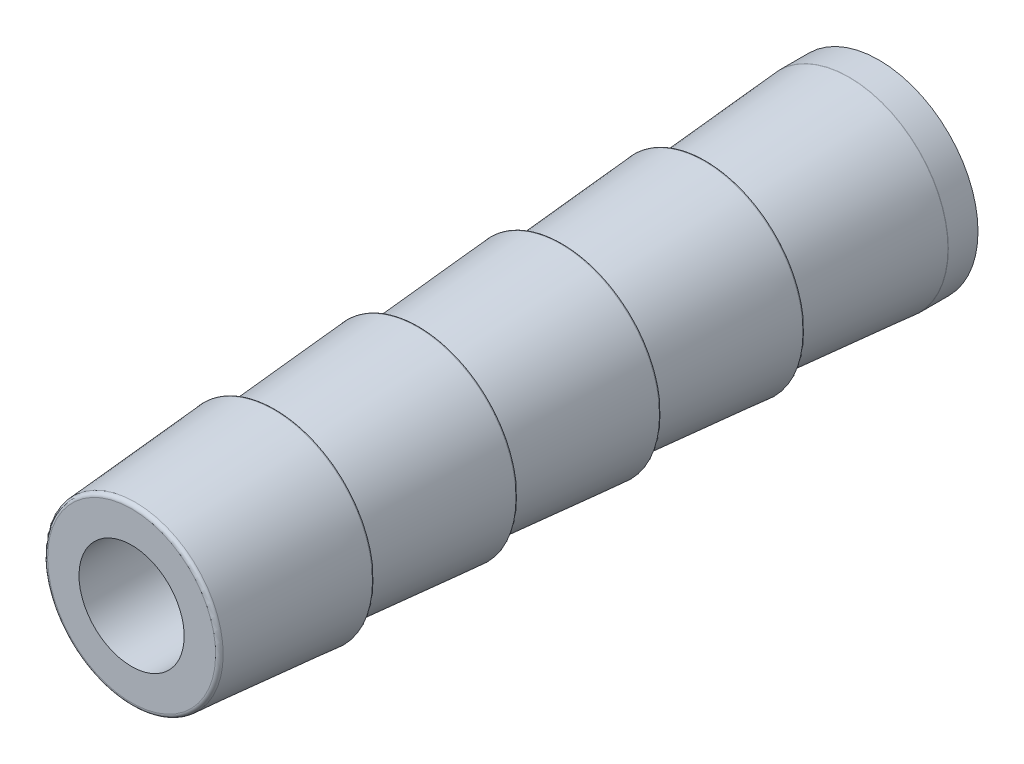
ISO-10303-21;
HEADER;
FILE_DESCRIPTION(('STEP AP214'),'2;1');
FILE_NAME('part.step','',(''),(''),'','','');
FILE_SCHEMA(('AUTOMOTIVE_DESIGN { 1 0 10303 214 1 1 1 1 }'));
ENDSEC;
DATA;
#1=APPLICATION_CONTEXT('core data for automotive mechanical design processes');
#2=APPLICATION_PROTOCOL_DEFINITION('international standard','automotive_design',2000,#1);
#3=PRODUCT_CONTEXT('',#1,'mechanical');
#4=PRODUCT('Part','Part','',(#3));
#5=PRODUCT_RELATED_PRODUCT_CATEGORY('part','',(#4));
#6=PRODUCT_DEFINITION_FORMATION('','',#4);
#7=PRODUCT_DEFINITION_CONTEXT('part definition',#1,'design');
#8=PRODUCT_DEFINITION('design','',#6,#7);
#9=PRODUCT_DEFINITION_SHAPE('','',#8);
#10=(LENGTH_UNIT() NAMED_UNIT(*) SI_UNIT(.MILLI.,.METRE.));
#11=(NAMED_UNIT(*) PLANE_ANGLE_UNIT() SI_UNIT($,.RADIAN.));
#12=(NAMED_UNIT(*) SI_UNIT($,.STERADIAN.) SOLID_ANGLE_UNIT());
#13=UNCERTAINTY_MEASURE_WITH_UNIT(LENGTH_MEASURE(1.E-05),#10,'distance_accuracy_value','');
#14=(GEOMETRIC_REPRESENTATION_CONTEXT(3) GLOBAL_UNCERTAINTY_ASSIGNED_CONTEXT((#13)) GLOBAL_UNIT_ASSIGNED_CONTEXT((#10,
#11,#12)) REPRESENTATION_CONTEXT('',''));
#15=CARTESIAN_POINT('',(0.,0.,0.));
#16=DIRECTION('',(0.,0.,1.));
#17=DIRECTION('',(1.,0.,0.));
#18=AXIS2_PLACEMENT_3D('',#15,#16,#17);
#19=CARTESIAN_POINT('',(0.,0.,0.));
#20=DIRECTION('',(0.,0.,1.));
#21=DIRECTION('',(0.,-1.,0.));
#22=AXIS2_PLACEMENT_3D('',#19,#20,#21);
#23=CYLINDRICAL_SURFACE('',#22,1.685925);
#24=CARTESIAN_POINT('',(0.,0.,15.2796875));
#25=DIRECTION('',(0.,0.,1.));
#26=DIRECTION('',(0.,-1.,0.));
#27=AXIS2_PLACEMENT_3D('',#24,#25,#26);
#28=CIRCLE('',#27,1.685925);
#29=CARTESIAN_POINT('',(0.,-1.685925,15.2796875));
#30=VERTEX_POINT('',#29);
#31=EDGE_CURVE('E11',#30,#30,#28,.T.);
#32=ORIENTED_EDGE('',*,*,#31,.T.);
#33=EDGE_LOOP('',(#32));
#34=FACE_BOUND('',#33,.T.);
#35=CARTESIAN_POINT('',(0.,0.,-8.6756875));
#36=DIRECTION('',(0.,0.,-1.));
#37=DIRECTION('',(-1.,0.,0.));
#38=AXIS2_PLACEMENT_3D('',#35,#36,#37);
#39=CIRCLE('',#38,1.685925);
#40=CARTESIAN_POINT('',(-1.685925,0.,-8.6756875));
#41=VERTEX_POINT('',#40);
#42=EDGE_CURVE('E112',#41,#41,#39,.F.);
#43=ORIENTED_EDGE('',*,*,#42,.F.);
#44=EDGE_LOOP('',(#43));
#45=FACE_BOUND('',#44,.T.);
#46=ADVANCED_FACE('F42',(#34,#45),#23,.F.);
#47=CARTESIAN_POINT('',(0.,0.,0.));
#48=DIRECTION('',(0.,0.,1.));
#49=DIRECTION('',(0.,-1.,0.));
#50=AXIS2_PLACEMENT_3D('',#47,#48,#49);
#51=CYLINDRICAL_SURFACE('',#50,3.175);
#52=CARTESIAN_POINT('',(0.,0.,-7.72425138700028));
#53=DIRECTION('',(0.,0.,-1.));
#54=DIRECTION('',(0.,1.,0.));
#55=AXIS2_PLACEMENT_3D('',#52,#53,#54);
#56=CIRCLE('',#55,3.175);
#57=CARTESIAN_POINT('',(0.,3.175,-7.72425138700028));
#58=VERTEX_POINT('',#57);
#59=EDGE_CURVE('E53',#58,#58,#56,.T.);
#60=ORIENTED_EDGE('',*,*,#59,.T.);
#61=EDGE_LOOP('',(#60));
#62=FACE_BOUND('',#61,.T.);
#63=CARTESIAN_POINT('',(0.,0.,-8.6756875));
#64=DIRECTION('',(0.,0.,-1.));
#65=DIRECTION('',(-1.,0.,0.));
#66=AXIS2_PLACEMENT_3D('',#63,#64,#65);
#67=CIRCLE('',#66,3.175);
#68=CARTESIAN_POINT('',(-3.175,0.,-8.6756875));
#69=VERTEX_POINT('',#68);
#70=EDGE_CURVE('E45',#69,#69,#67,.T.);
#71=ORIENTED_EDGE('',*,*,#70,.F.);
#72=EDGE_LOOP('',(#71));
#73=FACE_BOUND('',#72,.T.);
#74=ADVANCED_FACE('F121',(#62,#73),#51,.T.);
#75=CARTESIAN_POINT('',(0.,0.,1.52479375));
#76=DIRECTION('',(0.,0.,1.));
#77=DIRECTION('',(0.,-1.,0.));
#78=AXIS2_PLACEMENT_3D('',#75,#76,#77);
#79=TOROIDAL_SURFACE('',#78,3.12688179386419,0.04445);
#80=CARTESIAN_POINT('',(0.,0.,1.48034375));
#81=DIRECTION('',(0.,0.,1.));
#82=DIRECTION('',(0.,-1.,0.));
#83=AXIS2_PLACEMENT_3D('',#80,#81,#82);
#84=CIRCLE('',#83,3.12688179386419);
#85=CARTESIAN_POINT('',(0.,-3.12688179386419,1.48034375));
#86=VERTEX_POINT('',#85);
#87=EDGE_CURVE('E73',#86,#86,#84,.F.);
#88=ORIENTED_EDGE('',*,*,#87,.F.);
#89=EDGE_LOOP('',(#88));
#90=FACE_BOUND('',#89,.T.);
#91=CARTESIAN_POINT('',(0.,0.,1.52831107263397));
#92=DIRECTION('',(0.,0.,1.));
#93=DIRECTION('',(0.,-1.,0.));
#94=AXIS2_PLACEMENT_3D('',#91,#92,#93);
#95=CIRCLE('',#94,3.1711924126986);
#96=CARTESIAN_POINT('',(0.,-3.1711924126986,1.52831107263397));
#97=VERTEX_POINT('',#96);
#98=EDGE_CURVE('E91',#97,#97,#95,.T.);
#99=ORIENTED_EDGE('',*,*,#98,.F.);
#100=EDGE_LOOP('',(#99));
#101=FACE_BOUND('',#100,.T.);
#102=ADVANCED_FACE('F123',(#90,#101),#79,.T.);
#103=CARTESIAN_POINT('',(0.,0.,1.48034375));
#104=DIRECTION('',(0.,0.,-1.));
#105=DIRECTION('',(0.,1.,0.));
#106=AXIS2_PLACEMENT_3D('',#103,#104,#105);
#107=CONICAL_SURFACE('',#106,3.175,0.0792126806704457);
#108=CARTESIAN_POINT('',(0.,0.,6.03215767736603));
#109=DIRECTION('',(0.,0.,-1.));
#110=DIRECTION('',(0.,1.,0.));
#111=AXIS2_PLACEMENT_3D('',#108,#109,#110);
#112=CIRCLE('',#111,2.8136825873014);
#113=CARTESIAN_POINT('',(0.,2.8136825873014,6.03215767736603));
#114=VERTEX_POINT('',#113);
#115=EDGE_CURVE('E94',#114,#114,#112,.T.);
#116=ORIENTED_EDGE('',*,*,#115,.T.);
#117=EDGE_LOOP('',(#116));
#118=FACE_BOUND('',#117,.T.);
#119=ORIENTED_EDGE('',*,*,#98,.T.);
#120=EDGE_LOOP('',(#119));
#121=FACE_BOUND('',#120,.T.);
#122=ADVANCED_FACE('F130',(#118,#121),#107,.T.);
#123=CARTESIAN_POINT('',(0.,0.,6.035675));
#124=DIRECTION('',(0.,0.,1.));
#125=DIRECTION('',(0.,-1.,0.));
#126=AXIS2_PLACEMENT_3D('',#123,#124,#125);
#127=TOROIDAL_SURFACE('',#126,2.85799320613581,0.04445);
#128=ORIENTED_EDGE('',*,*,#115,.F.);
#129=EDGE_LOOP('',(#128));
#130=FACE_BOUND('',#129,.T.);
#131=CARTESIAN_POINT('',(0.,0.,6.080125));
#132=DIRECTION('',(0.,0.,1.));
#133=DIRECTION('',(0.,-1.,0.));
#134=AXIS2_PLACEMENT_3D('',#131,#132,#133);
#135=CIRCLE('',#134,2.85799320613581);
#136=CARTESIAN_POINT('',(0.,-2.85799320613581,6.080125));
#137=VERTEX_POINT('',#136);
#138=EDGE_CURVE('E88',#137,#137,#135,.T.);
#139=ORIENTED_EDGE('',*,*,#138,.F.);
#140=EDGE_LOOP('',(#139));
#141=FACE_BOUND('',#140,.T.);
#142=ADVANCED_FACE('F157',(#130,#141),#127,.F.);
#143=CARTESIAN_POINT('',(0.,3.175,6.080125));
#144=DIRECTION('',(0.,0.,1.));
#145=DIRECTION('',(0.,-1.,0.));
#146=AXIS2_PLACEMENT_3D('',#143,#144,#145);
#147=PLANE('',#146);
#148=ORIENTED_EDGE('',*,*,#138,.T.);
#149=EDGE_LOOP('',(#148));
#150=FACE_BOUND('',#149,.T.);
#151=CARTESIAN_POINT('',(0.,0.,6.080125));
#152=DIRECTION('',(0.,0.,1.));
#153=DIRECTION('',(0.,-1.,0.));
#154=AXIS2_PLACEMENT_3D('',#151,#152,#153);
#155=CIRCLE('',#154,3.12688179386419);
#156=CARTESIAN_POINT('',(0.,-3.12688179386419,6.080125));
#157=VERTEX_POINT('',#156);
#158=EDGE_CURVE('E85',#157,#157,#155,.F.);
#159=ORIENTED_EDGE('',*,*,#158,.T.);
#160=EDGE_LOOP('',(#159));
#161=FACE_BOUND('',#160,.T.);
#162=ADVANCED_FACE('F159',(#150,#161),#147,.F.);
#163=CARTESIAN_POINT('',(0.,0.,6.124575));
#164=DIRECTION('',(0.,0.,1.));
#165=DIRECTION('',(0.,-1.,0.));
#166=AXIS2_PLACEMENT_3D('',#163,#164,#165);
#167=TOROIDAL_SURFACE('',#166,3.12688179386419,0.04445);
#168=ORIENTED_EDGE('',*,*,#158,.F.);
#169=EDGE_LOOP('',(#168));
#170=FACE_BOUND('',#169,.T.);
#171=CARTESIAN_POINT('',(0.,0.,6.12809232263396));
#172=DIRECTION('',(0.,0.,1.));
#173=DIRECTION('',(0.,-1.,0.));
#174=AXIS2_PLACEMENT_3D('',#171,#172,#173);
#175=CIRCLE('',#174,3.1711924126986);
#176=CARTESIAN_POINT('',(0.,-3.1711924126986,6.12809232263396));
#177=VERTEX_POINT('',#176);
#178=EDGE_CURVE('E103',#177,#177,#175,.T.);
#179=ORIENTED_EDGE('',*,*,#178,.F.);
#180=EDGE_LOOP('',(#179));
#181=FACE_BOUND('',#180,.T.);
#182=ADVANCED_FACE('F162',(#170,#181),#167,.T.);
#183=CARTESIAN_POINT('',(0.,0.,6.080125));
#184=DIRECTION('',(0.,0.,-1.));
#185=DIRECTION('',(0.,1.,0.));
#186=AXIS2_PLACEMENT_3D('',#183,#184,#185);
#187=CONICAL_SURFACE('',#186,3.175,0.0792126806704457);
#188=CARTESIAN_POINT('',(0.,0.,10.631938927366));
#189=DIRECTION('',(0.,0.,-1.));
#190=DIRECTION('',(0.,1.,0.));
#191=AXIS2_PLACEMENT_3D('',#188,#189,#190);
#192=CIRCLE('',#191,2.8136825873014);
#193=CARTESIAN_POINT('',(0.,2.8136825873014,10.631938927366));
#194=VERTEX_POINT('',#193);
#195=EDGE_CURVE('E106',#194,#194,#192,.T.);
#196=ORIENTED_EDGE('',*,*,#195,.T.);
#197=EDGE_LOOP('',(#196));
#198=FACE_BOUND('',#197,.T.);
#199=ORIENTED_EDGE('',*,*,#178,.T.);
#200=EDGE_LOOP('',(#199));
#201=FACE_BOUND('',#200,.T.);
#202=ADVANCED_FACE('F164',(#198,#201),#187,.T.);
#203=CARTESIAN_POINT('',(0.,0.,10.63545625));
#204=DIRECTION('',(0.,0.,1.));
#205=DIRECTION('',(0.,-1.,0.));
#206=AXIS2_PLACEMENT_3D('',#203,#204,#205);
#207=TOROIDAL_SURFACE('',#206,2.85799320613581,0.04445);
#208=ORIENTED_EDGE('',*,*,#195,.F.);
#209=EDGE_LOOP('',(#208));
#210=FACE_BOUND('',#209,.T.);
#211=CARTESIAN_POINT('',(0.,0.,10.67990625));
#212=DIRECTION('',(0.,0.,1.));
#213=DIRECTION('',(0.,-1.,0.));
#214=AXIS2_PLACEMENT_3D('',#211,#212,#213);
#215=CIRCLE('',#214,2.85799320613581);
#216=CARTESIAN_POINT('',(0.,-2.85799320613581,10.67990625));
#217=VERTEX_POINT('',#216);
#218=EDGE_CURVE('E100',#217,#217,#215,.T.);
#219=ORIENTED_EDGE('',*,*,#218,.F.);
#220=EDGE_LOOP('',(#219));
#221=FACE_BOUND('',#220,.T.);
#222=ADVANCED_FACE('F167',(#210,#221),#207,.F.);
#223=CARTESIAN_POINT('',(0.,3.175,10.67990625));
#224=DIRECTION('',(0.,0.,1.));
#225=DIRECTION('',(0.,-1.,0.));
#226=AXIS2_PLACEMENT_3D('',#223,#224,#225);
#227=PLANE('',#226);
#228=ORIENTED_EDGE('',*,*,#218,.T.);
#229=EDGE_LOOP('',(#228));
#230=FACE_BOUND('',#229,.T.);
#231=CARTESIAN_POINT('',(0.,0.,10.67990625));
#232=DIRECTION('',(0.,0.,1.));
#233=DIRECTION('',(0.,-1.,0.));
#234=AXIS2_PLACEMENT_3D('',#231,#232,#233);
#235=CIRCLE('',#234,3.12688179386419);
#236=CARTESIAN_POINT('',(0.,-3.12688179386419,10.67990625));
#237=VERTEX_POINT('',#236);
#238=EDGE_CURVE('E97',#237,#237,#235,.F.);
#239=ORIENTED_EDGE('',*,*,#238,.T.);
#240=EDGE_LOOP('',(#239));
#241=FACE_BOUND('',#240,.T.);
#242=ADVANCED_FACE('F169',(#230,#241),#227,.F.);
#243=CARTESIAN_POINT('',(0.,0.,10.72435625));
#244=DIRECTION('',(0.,0.,1.));
#245=DIRECTION('',(0.,-1.,0.));
#246=AXIS2_PLACEMENT_3D('',#243,#244,#245);
#247=TOROIDAL_SURFACE('',#246,3.12688179386419,0.04445);
#248=ORIENTED_EDGE('',*,*,#238,.F.);
#249=EDGE_LOOP('',(#248));
#250=FACE_BOUND('',#249,.T.);
#251=CARTESIAN_POINT('',(0.,0.,10.727873572634));
#252=DIRECTION('',(0.,0.,1.));
#253=DIRECTION('',(0.,-1.,0.));
#254=AXIS2_PLACEMENT_3D('',#251,#252,#253);
#255=CIRCLE('',#254,3.1711924126986);
#256=CARTESIAN_POINT('',(0.,-3.1711924126986,10.727873572634));
#257=VERTEX_POINT('',#256);
#258=EDGE_CURVE('E109',#257,#257,#255,.T.);
#259=ORIENTED_EDGE('',*,*,#258,.F.);
#260=EDGE_LOOP('',(#259));
#261=FACE_BOUND('',#260,.T.);
#262=ADVANCED_FACE('F172',(#250,#261),#247,.T.);
#263=CARTESIAN_POINT('',(0.,0.,10.67990625));
#264=DIRECTION('',(0.,0.,-1.));
#265=DIRECTION('',(0.,1.,0.));
#266=AXIS2_PLACEMENT_3D('',#263,#264,#265);
#267=CONICAL_SURFACE('',#266,3.175,0.0792126806704456);
#268=ORIENTED_EDGE('',*,*,#258,.T.);
#269=EDGE_LOOP('',(#268));
#270=FACE_BOUND('',#269,.T.);
#271=CARTESIAN_POINT('',(0.,0.,15.1627369932399));
#272=DIRECTION('',(0.,0.,1.));
#273=DIRECTION('',(0.,-1.,0.));
#274=AXIS2_PLACEMENT_3D('',#271,#272,#273);
#275=CIRCLE('',#274,2.81915838793954);
#276=CARTESIAN_POINT('',(0.,-2.81915838793954,15.1627369932399));
#277=VERTEX_POINT('',#276);
#278=EDGE_CURVE('E61',#277,#277,#275,.F.);
#279=ORIENTED_EDGE('',*,*,#278,.T.);
#280=EDGE_LOOP('',(#279));
#281=FACE_BOUND('',#280,.T.);
#282=ADVANCED_FACE('F174',(#270,#281),#267,.T.);
#283=CARTESIAN_POINT('',(0.,0.,15.1526875));
#284=DIRECTION('',(0.,0.,-1.));
#285=DIRECTION('',(0.,1.,0.));
#286=AXIS2_PLACEMENT_3D('',#283,#284,#285);
#287=TOROIDAL_SURFACE('',#286,2.69255661984122,0.127);
#288=ORIENTED_EDGE('',*,*,#278,.F.);
#289=EDGE_LOOP('',(#288));
#290=FACE_BOUND('',#289,.T.);
#291=CARTESIAN_POINT('',(0.,0.,15.2796875));
#292=DIRECTION('',(0.,0.,-1.));
#293=DIRECTION('',(0.,1.,0.));
#294=AXIS2_PLACEMENT_3D('',#291,#292,#293);
#295=CIRCLE('',#294,2.69255661984122);
#296=CARTESIAN_POINT('',(0.,2.69255661984122,15.2796875));
#297=VERTEX_POINT('',#296);
#298=EDGE_CURVE('E58',#297,#297,#295,.F.);
#299=ORIENTED_EDGE('',*,*,#298,.F.);
#300=EDGE_LOOP('',(#299));
#301=FACE_BOUND('',#300,.T.);
#302=ADVANCED_FACE('F177',(#290,#301),#287,.T.);
#303=CARTESIAN_POINT('',(0.,1.685925,15.2796875));
#304=DIRECTION('',(0.,0.,-1.));
#305=DIRECTION('',(0.,1.,0.));
#306=AXIS2_PLACEMENT_3D('',#303,#304,#305);
#307=PLANE('',#306);
#308=ORIENTED_EDGE('',*,*,#298,.T.);
#309=EDGE_LOOP('',(#308));
#310=FACE_BOUND('',#309,.T.);
#311=ORIENTED_EDGE('',*,*,#31,.F.);
#312=EDGE_LOOP('',(#311));
#313=FACE_BOUND('',#312,.T.);
#314=ADVANCED_FACE('F153',(#310,#313),#307,.F.);
#315=CARTESIAN_POINT('',(0.,3.175,1.48034375));
#316=DIRECTION('',(0.,0.,1.));
#317=DIRECTION('',(0.,-1.,0.));
#318=AXIS2_PLACEMENT_3D('',#315,#316,#317);
#319=PLANE('',#318);
#320=CARTESIAN_POINT('',(0.,0.,1.48034375));
#321=DIRECTION('',(0.,0.,1.));
#322=DIRECTION('',(0.,-1.,0.));
#323=AXIS2_PLACEMENT_3D('',#320,#321,#322);
#324=CIRCLE('',#323,2.85799320613581);
#325=CARTESIAN_POINT('',(0.,-2.85799320613581,1.48034375));
#326=VERTEX_POINT('',#325);
#327=EDGE_CURVE('E76',#326,#326,#324,.T.);
#328=ORIENTED_EDGE('',*,*,#327,.T.);
#329=EDGE_LOOP('',(#328));
#330=FACE_BOUND('',#329,.T.);
#331=ORIENTED_EDGE('',*,*,#87,.T.);
#332=EDGE_LOOP('',(#331));
#333=FACE_BOUND('',#332,.T.);
#334=ADVANCED_FACE('F150',(#330,#333),#319,.F.);
#335=CARTESIAN_POINT('',(0.,0.,1.43589375));
#336=DIRECTION('',(0.,0.,1.));
#337=DIRECTION('',(0.,-1.,0.));
#338=AXIS2_PLACEMENT_3D('',#335,#336,#337);
#339=TOROIDAL_SURFACE('',#338,2.85799320613581,0.04445);
#340=CARTESIAN_POINT('',(0.,0.,1.43237642736603));
#341=DIRECTION('',(0.,0.,-1.));
#342=DIRECTION('',(0.,1.,0.));
#343=AXIS2_PLACEMENT_3D('',#340,#341,#342);
#344=CIRCLE('',#343,2.8136825873014);
#345=CARTESIAN_POINT('',(0.,2.8136825873014,1.43237642736603));
#346=VERTEX_POINT('',#345);
#347=EDGE_CURVE('E82',#346,#346,#344,.T.);
#348=ORIENTED_EDGE('',*,*,#347,.F.);
#349=EDGE_LOOP('',(#348));
#350=FACE_BOUND('',#349,.T.);
#351=ORIENTED_EDGE('',*,*,#327,.F.);
#352=EDGE_LOOP('',(#351));
#353=FACE_BOUND('',#352,.T.);
#354=ADVANCED_FACE('F148',(#350,#353),#339,.F.);
#355=CARTESIAN_POINT('',(0.,0.,-3.1194375));
#356=DIRECTION('',(0.,0.,-1.));
#357=DIRECTION('',(0.,1.,0.));
#358=AXIS2_PLACEMENT_3D('',#355,#356,#357);
#359=CONICAL_SURFACE('',#358,3.175,0.0792126806704458);
#360=ORIENTED_EDGE('',*,*,#347,.T.);
#361=EDGE_LOOP('',(#360));
#362=FACE_BOUND('',#361,.T.);
#363=CARTESIAN_POINT('',(0.,0.,-3.07147017736604));
#364=DIRECTION('',(0.,0.,1.));
#365=DIRECTION('',(0.,-1.,0.));
#366=AXIS2_PLACEMENT_3D('',#363,#364,#365);
#367=CIRCLE('',#366,3.1711924126986);
#368=CARTESIAN_POINT('',(0.,-3.1711924126986,-3.07147017736604));
#369=VERTEX_POINT('',#368);
#370=EDGE_CURVE('E79',#369,#369,#367,.T.);
#371=ORIENTED_EDGE('',*,*,#370,.T.);
#372=EDGE_LOOP('',(#371));
#373=FACE_BOUND('',#372,.T.);
#374=ADVANCED_FACE('F145',(#362,#373),#359,.T.);
#375=CARTESIAN_POINT('',(0.,0.,-3.0749875));
#376=DIRECTION('',(0.,0.,1.));
#377=DIRECTION('',(0.,-1.,0.));
#378=AXIS2_PLACEMENT_3D('',#375,#376,#377);
#379=TOROIDAL_SURFACE('',#378,3.12688179386419,0.04445);
#380=CARTESIAN_POINT('',(0.,0.,-3.1194375));
#381=DIRECTION('',(0.,0.,1.));
#382=DIRECTION('',(0.,-1.,0.));
#383=AXIS2_PLACEMENT_3D('',#380,#381,#382);
#384=CIRCLE('',#383,3.12688179386419);
#385=CARTESIAN_POINT('',(0.,-3.12688179386419,-3.1194375));
#386=VERTEX_POINT('',#385);
#387=EDGE_CURVE('E64',#386,#386,#384,.F.);
#388=ORIENTED_EDGE('',*,*,#387,.F.);
#389=EDGE_LOOP('',(#388));
#390=FACE_BOUND('',#389,.T.);
#391=ORIENTED_EDGE('',*,*,#370,.F.);
#392=EDGE_LOOP('',(#391));
#393=FACE_BOUND('',#392,.T.);
#394=ADVANCED_FACE('F143',(#390,#393),#379,.T.);
#395=CARTESIAN_POINT('',(0.,3.175,-3.1194375));
#396=DIRECTION('',(0.,0.,1.));
#397=DIRECTION('',(0.,-1.,0.));
#398=AXIS2_PLACEMENT_3D('',#395,#396,#397);
#399=PLANE('',#398);
#400=CARTESIAN_POINT('',(0.,0.,-3.1194375));
#401=DIRECTION('',(0.,0.,1.));
#402=DIRECTION('',(0.,-1.,0.));
#403=AXIS2_PLACEMENT_3D('',#400,#401,#402);
#404=CIRCLE('',#403,2.85799320613581);
#405=CARTESIAN_POINT('',(0.,-2.85799320613581,-3.1194375));
#406=VERTEX_POINT('',#405);
#407=EDGE_CURVE('E67',#406,#406,#404,.T.);
#408=ORIENTED_EDGE('',*,*,#407,.T.);
#409=EDGE_LOOP('',(#408));
#410=FACE_BOUND('',#409,.T.);
#411=ORIENTED_EDGE('',*,*,#387,.T.);
#412=EDGE_LOOP('',(#411));
#413=FACE_BOUND('',#412,.T.);
#414=ADVANCED_FACE('F140',(#410,#413),#399,.F.);
#415=CARTESIAN_POINT('',(0.,0.,-3.1638875));
#416=DIRECTION('',(0.,0.,1.));
#417=DIRECTION('',(0.,-1.,0.));
#418=AXIS2_PLACEMENT_3D('',#415,#416,#417);
#419=TOROIDAL_SURFACE('',#418,2.85799320613581,0.04445);
#420=CARTESIAN_POINT('',(0.,0.,-3.16740482263397));
#421=DIRECTION('',(0.,0.,-1.));
#422=DIRECTION('',(0.,1.,0.));
#423=AXIS2_PLACEMENT_3D('',#420,#421,#422);
#424=CIRCLE('',#423,2.8136825873014);
#425=CARTESIAN_POINT('',(0.,2.8136825873014,-3.16740482263397));
#426=VERTEX_POINT('',#425);
#427=EDGE_CURVE('E70',#426,#426,#424,.T.);
#428=ORIENTED_EDGE('',*,*,#427,.F.);
#429=EDGE_LOOP('',(#428));
#430=FACE_BOUND('',#429,.T.);
#431=ORIENTED_EDGE('',*,*,#407,.F.);
#432=EDGE_LOOP('',(#431));
#433=FACE_BOUND('',#432,.T.);
#434=ADVANCED_FACE('F138',(#430,#433),#419,.F.);
#435=CARTESIAN_POINT('',(0.,0.,-7.71921875000001));
#436=DIRECTION('',(0.,0.,-1.));
#437=DIRECTION('',(0.,1.,0.));
#438=AXIS2_PLACEMENT_3D('',#435,#436,#437);
#439=CONICAL_SURFACE('',#438,3.175,0.0792126806704457);
#440=ORIENTED_EDGE('',*,*,#427,.T.);
#441=EDGE_LOOP('',(#440));
#442=FACE_BOUND('',#441,.T.);
#443=CARTESIAN_POINT('',(0.,0.,-7.71420189376038));
#444=DIRECTION('',(0.,0.,1.));
#445=DIRECTION('',(0.,-1.,0.));
#446=AXIS2_PLACEMENT_3D('',#443,#444,#445);
#447=CIRCLE('',#446,3.17460176809832);
#448=CARTESIAN_POINT('',(0.,-3.17460176809832,-7.71420189376038));
#449=VERTEX_POINT('',#448);
#450=EDGE_CURVE('E49',#449,#449,#447,.T.);
#451=ORIENTED_EDGE('',*,*,#450,.T.);
#452=EDGE_LOOP('',(#451));
#453=FACE_BOUND('',#452,.T.);
#454=ADVANCED_FACE('F134',(#442,#453),#439,.T.);
#455=CARTESIAN_POINT('',(0.,0.,-7.72425138700028));
#456=DIRECTION('',(0.,0.,-1.));
#457=DIRECTION('',(0.,1.,0.));
#458=AXIS2_PLACEMENT_3D('',#455,#456,#457);
#459=TOROIDAL_SURFACE('',#458,3.048,0.127);
#460=ORIENTED_EDGE('',*,*,#59,.F.);
#461=EDGE_LOOP('',(#460));
#462=FACE_BOUND('',#461,.T.);
#463=ORIENTED_EDGE('',*,*,#450,.F.);
#464=EDGE_LOOP('',(#463));
#465=FACE_BOUND('',#464,.T.);
#466=ADVANCED_FACE('F137',(#462,#465),#459,.T.);
#467=CARTESIAN_POINT('',(0.,0.,-8.6756875));
#468=DIRECTION('',(0.,0.,-1.));
#469=DIRECTION('',(-1.,0.,0.));
#470=AXIS2_PLACEMENT_3D('',#467,#468,#469);
#471=PLANE('',#470);
#472=ORIENTED_EDGE('',*,*,#70,.T.);
#473=EDGE_LOOP('',(#472));
#474=FACE_BOUND('',#473,.T.);
#475=ORIENTED_EDGE('',*,*,#42,.T.);
#476=EDGE_LOOP('',(#475));
#477=FACE_BOUND('',#476,.T.);
#478=ADVANCED_FACE('F119',(#474,#477),#471,.T.);
#479=CLOSED_SHELL('',(#46,#74,#102,#122,#142,#162,#182,#202,#222,#242,#262,#282,#302,#314,#334,
#354,#374,#394,#414,#434,#454,#466,#478));
#480=MANIFOLD_SOLID_BREP('B2',#479);
#481=ADVANCED_BREP_SHAPE_REPRESENTATION('',(#18,#480),#14);
#482=SHAPE_DEFINITION_REPRESENTATION(#9,#481);
ENDSEC;
END-ISO-10303-21;
